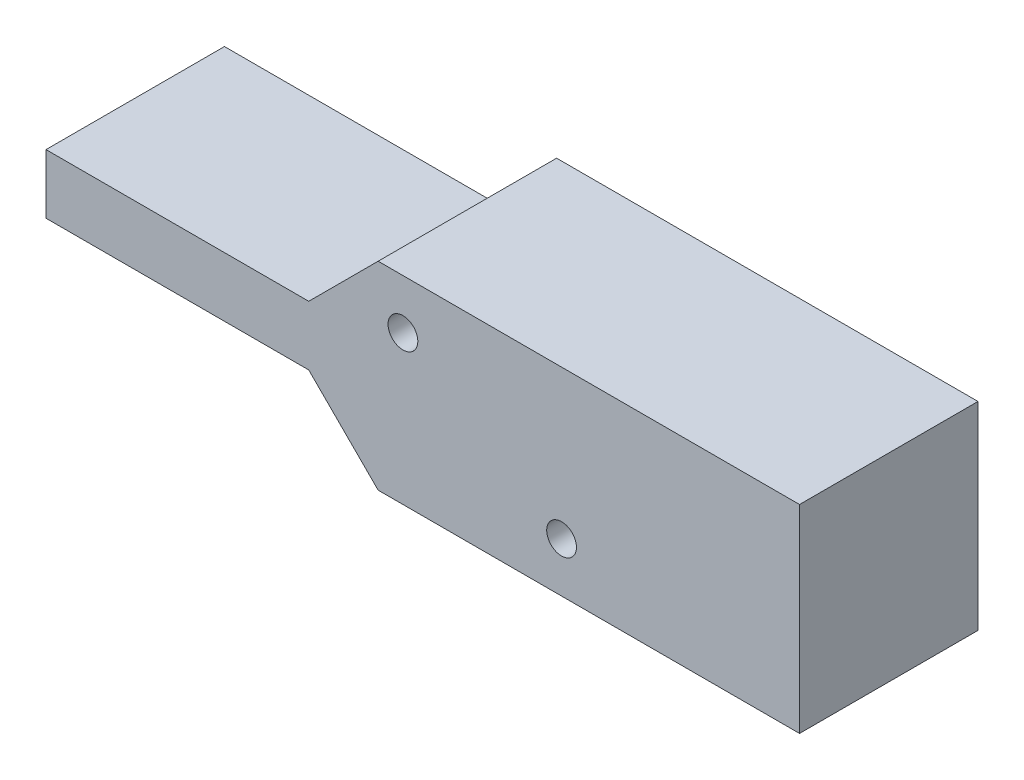
ISO-10303-21;
HEADER;
FILE_DESCRIPTION(('STEP AP214'),'2;1');
FILE_NAME('part.step','',(''),(''),'','','');
FILE_SCHEMA(('AUTOMOTIVE_DESIGN { 1 0 10303 214 1 1 1 1 }'));
ENDSEC;
DATA;
#1=APPLICATION_CONTEXT('core data for automotive mechanical design processes');
#2=APPLICATION_PROTOCOL_DEFINITION('international standard','automotive_design',2000,#1);
#3=PRODUCT_CONTEXT('',#1,'mechanical');
#4=PRODUCT('Part','Part','',(#3));
#5=PRODUCT_RELATED_PRODUCT_CATEGORY('part','',(#4));
#6=PRODUCT_DEFINITION_FORMATION('','',#4);
#7=PRODUCT_DEFINITION_CONTEXT('part definition',#1,'design');
#8=PRODUCT_DEFINITION('design','',#6,#7);
#9=PRODUCT_DEFINITION_SHAPE('','',#8);
#10=(LENGTH_UNIT() NAMED_UNIT(*) SI_UNIT(.MILLI.,.METRE.));
#11=(NAMED_UNIT(*) PLANE_ANGLE_UNIT() SI_UNIT($,.RADIAN.));
#12=(NAMED_UNIT(*) SI_UNIT($,.STERADIAN.) SOLID_ANGLE_UNIT());
#13=UNCERTAINTY_MEASURE_WITH_UNIT(LENGTH_MEASURE(1.E-05),#10,'distance_accuracy_value','');
#14=(GEOMETRIC_REPRESENTATION_CONTEXT(3) GLOBAL_UNCERTAINTY_ASSIGNED_CONTEXT((#13)) GLOBAL_UNIT_ASSIGNED_CONTEXT((#10,
#11,#12)) REPRESENTATION_CONTEXT('',''));
#15=CARTESIAN_POINT('',(0.,0.,0.));
#16=DIRECTION('',(0.,0.,1.));
#17=DIRECTION('',(1.,0.,0.));
#18=AXIS2_PLACEMENT_3D('',#15,#16,#17);
#19=CARTESIAN_POINT('',(0.,0.,18.));
#20=DIRECTION('',(0.,0.,1.));
#21=DIRECTION('',(1.,0.,0.));
#22=AXIS2_PLACEMENT_3D('',#19,#20,#21);
#23=PLANE('',#22);
#24=CARTESIAN_POINT('',(-40.,-5.,18.));
#25=DIRECTION('',(0.,0.,1.));
#26=DIRECTION('',(1.,0.,0.));
#27=AXIS2_PLACEMENT_3D('',#24,#25,#26);
#28=CIRCLE('',#27,1.5);
#29=CARTESIAN_POINT('',(-38.5,-5.,18.));
#30=VERTEX_POINT('',#29);
#31=EDGE_CURVE('E134',#30,#30,#28,.T.);
#32=ORIENTED_EDGE('',*,*,#31,.F.);
#33=EDGE_LOOP('',(#32));
#34=FACE_BOUND('',#33,.T.);
#35=DIRECTION('',(-1.,0.,0.));
#36=VECTOR('',#35,1.);
#37=CARTESIAN_POINT('',(-49.5,-7.,18.));
#38=LINE('',#37,#36);
#39=CARTESIAN_POINT('',(-49.5,-7.,18.));
#40=VERTEX_POINT('',#39);
#41=CARTESIAN_POINT('',(-76.,-7.,18.));
#42=VERTEX_POINT('',#41);
#43=EDGE_CURVE('E145',#40,#42,#38,.T.);
#44=ORIENTED_EDGE('',*,*,#43,.T.);
#45=DIRECTION('',(0.,-1.,0.));
#46=VECTOR('',#45,1.);
#47=CARTESIAN_POINT('',(-76.,-7.,18.));
#48=LINE('',#47,#46);
#49=CARTESIAN_POINT('',(-76.,-13.,18.));
#50=VERTEX_POINT('',#49);
#51=EDGE_CURVE('E93',#42,#50,#48,.T.);
#52=ORIENTED_EDGE('',*,*,#51,.T.);
#53=DIRECTION('',(1.,0.,0.));
#54=VECTOR('',#53,1.);
#55=CARTESIAN_POINT('',(-76.,-13.,18.));
#56=LINE('',#55,#54);
#57=CARTESIAN_POINT('',(-49.5,-13.,18.));
#58=VERTEX_POINT('',#57);
#59=EDGE_CURVE('E160',#50,#58,#56,.T.);
#60=ORIENTED_EDGE('',*,*,#59,.T.);
#61=DIRECTION('',(0.707106781186547,-0.707106781186547,0.));
#62=VECTOR('',#61,1.);
#63=CARTESIAN_POINT('',(-49.5,-13.,18.));
#64=LINE('',#63,#62);
#65=CARTESIAN_POINT('',(-42.5,-20.,18.));
#66=VERTEX_POINT('',#65);
#67=EDGE_CURVE('E173',#58,#66,#64,.T.);
#68=ORIENTED_EDGE('',*,*,#67,.T.);
#69=DIRECTION('',(1.,0.,0.));
#70=VECTOR('',#69,1.);
#71=CARTESIAN_POINT('',(-42.5,-20.,18.));
#72=LINE('',#71,#70);
#73=CARTESIAN_POINT('',(0.,-20.,18.));
#74=VERTEX_POINT('',#73);
#75=EDGE_CURVE('E112',#66,#74,#72,.T.);
#76=ORIENTED_EDGE('',*,*,#75,.T.);
#77=DIRECTION('',(0.,1.,0.));
#78=VECTOR('',#77,1.);
#79=CARTESIAN_POINT('',(0.,-20.,18.));
#80=LINE('',#79,#78);
#81=CARTESIAN_POINT('',(0.,0.,18.));
#82=VERTEX_POINT('',#81);
#83=EDGE_CURVE('E106',#74,#82,#80,.T.);
#84=ORIENTED_EDGE('',*,*,#83,.T.);
#85=DIRECTION('',(-1.,0.,0.));
#86=VECTOR('',#85,1.);
#87=CARTESIAN_POINT('',(0.,0.,18.));
#88=LINE('',#87,#86);
#89=CARTESIAN_POINT('',(-42.5,0.,18.));
#90=VERTEX_POINT('',#89);
#91=EDGE_CURVE('E110',#82,#90,#88,.T.);
#92=ORIENTED_EDGE('',*,*,#91,.T.);
#93=DIRECTION('',(-0.707106781186548,-0.707106781186547,0.));
#94=VECTOR('',#93,1.);
#95=CARTESIAN_POINT('',(-42.5,0.,18.));
#96=LINE('',#95,#94);
#97=EDGE_CURVE('E50',#90,#40,#96,.T.);
#98=ORIENTED_EDGE('',*,*,#97,.T.);
#99=EDGE_LOOP('',(#44,#52,#60,#68,#76,#84,#92,#98));
#100=FACE_BOUND('',#99,.T.);
#101=CARTESIAN_POINT('',(-24.,-15.,18.));
#102=DIRECTION('',(0.,0.,1.));
#103=DIRECTION('',(1.,0.,0.));
#104=AXIS2_PLACEMENT_3D('',#101,#102,#103);
#105=CIRCLE('',#104,1.5);
#106=CARTESIAN_POINT('',(-22.5,-15.,18.));
#107=VERTEX_POINT('',#106);
#108=EDGE_CURVE('E182',#107,#107,#105,.T.);
#109=ORIENTED_EDGE('',*,*,#108,.F.);
#110=EDGE_LOOP('',(#109));
#111=FACE_BOUND('',#110,.T.);
#112=ADVANCED_FACE('F33',(#34,#100,#111),#23,.T.);
#113=CARTESIAN_POINT('',(0.,0.,0.));
#114=DIRECTION('',(0.,0.,1.));
#115=DIRECTION('',(1.,0.,0.));
#116=AXIS2_PLACEMENT_3D('',#113,#114,#115);
#117=PLANE('',#116);
#118=CARTESIAN_POINT('',(-40.,-5.,0.));
#119=DIRECTION('',(0.,0.,1.));
#120=DIRECTION('',(1.,0.,0.));
#121=AXIS2_PLACEMENT_3D('',#118,#119,#120);
#122=CIRCLE('',#121,1.5);
#123=CARTESIAN_POINT('',(-38.5,-5.,0.));
#124=VERTEX_POINT('',#123);
#125=EDGE_CURVE('E179',#124,#124,#122,.T.);
#126=ORIENTED_EDGE('',*,*,#125,.T.);
#127=EDGE_LOOP('',(#126));
#128=FACE_BOUND('',#127,.T.);
#129=DIRECTION('',(-1.,0.,0.));
#130=VECTOR('',#129,1.);
#131=CARTESIAN_POINT('',(-49.5,-7.,0.));
#132=LINE('',#131,#130);
#133=CARTESIAN_POINT('',(-49.5,-7.,0.));
#134=VERTEX_POINT('',#133);
#135=CARTESIAN_POINT('',(-76.,-7.,0.));
#136=VERTEX_POINT('',#135);
#137=EDGE_CURVE('E130',#134,#136,#132,.T.);
#138=ORIENTED_EDGE('',*,*,#137,.F.);
#139=DIRECTION('',(-0.707106781186548,-0.707106781186547,0.));
#140=VECTOR('',#139,1.);
#141=CARTESIAN_POINT('',(-42.5,0.,0.));
#142=LINE('',#141,#140);
#143=CARTESIAN_POINT('',(-42.5,0.,0.));
#144=VERTEX_POINT('',#143);
#145=EDGE_CURVE('E85',#144,#134,#142,.T.);
#146=ORIENTED_EDGE('',*,*,#145,.F.);
#147=DIRECTION('',(-1.,0.,0.));
#148=VECTOR('',#147,1.);
#149=CARTESIAN_POINT('',(0.,0.,0.));
#150=LINE('',#149,#148);
#151=CARTESIAN_POINT('',(0.,0.,0.));
#152=VERTEX_POINT('',#151);
#153=EDGE_CURVE('E79',#152,#144,#150,.T.);
#154=ORIENTED_EDGE('',*,*,#153,.F.);
#155=DIRECTION('',(0.,1.,0.));
#156=VECTOR('',#155,1.);
#157=CARTESIAN_POINT('',(0.,-20.,0.));
#158=LINE('',#157,#156);
#159=CARTESIAN_POINT('',(0.,-20.,0.));
#160=VERTEX_POINT('',#159);
#161=EDGE_CURVE('E120',#160,#152,#158,.T.);
#162=ORIENTED_EDGE('',*,*,#161,.F.);
#163=DIRECTION('',(1.,0.,0.));
#164=VECTOR('',#163,1.);
#165=CARTESIAN_POINT('',(-42.5,-20.,0.));
#166=LINE('',#165,#164);
#167=CARTESIAN_POINT('',(-42.5,-20.,0.));
#168=VERTEX_POINT('',#167);
#169=EDGE_CURVE('E140',#168,#160,#166,.T.);
#170=ORIENTED_EDGE('',*,*,#169,.F.);
#171=DIRECTION('',(0.707106781186547,-0.707106781186547,0.));
#172=VECTOR('',#171,1.);
#173=CARTESIAN_POINT('',(-49.5,-13.,0.));
#174=LINE('',#173,#172);
#175=CARTESIAN_POINT('',(-49.5,-13.,0.));
#176=VERTEX_POINT('',#175);
#177=EDGE_CURVE('E138',#176,#168,#174,.T.);
#178=ORIENTED_EDGE('',*,*,#177,.F.);
#179=DIRECTION('',(1.,0.,0.));
#180=VECTOR('',#179,1.);
#181=CARTESIAN_POINT('',(-76.,-13.,0.));
#182=LINE('',#181,#180);
#183=CARTESIAN_POINT('',(-76.,-13.,0.));
#184=VERTEX_POINT('',#183);
#185=EDGE_CURVE('E136',#184,#176,#182,.T.);
#186=ORIENTED_EDGE('',*,*,#185,.F.);
#187=DIRECTION('',(0.,-1.,0.));
#188=VECTOR('',#187,1.);
#189=CARTESIAN_POINT('',(-76.,-7.,0.));
#190=LINE('',#189,#188);
#191=EDGE_CURVE('E133',#136,#184,#190,.T.);
#192=ORIENTED_EDGE('',*,*,#191,.F.);
#193=EDGE_LOOP('',(#138,#146,#154,#162,#170,#178,#186,#192));
#194=FACE_BOUND('',#193,.T.);
#195=CARTESIAN_POINT('',(-24.,-15.,0.));
#196=DIRECTION('',(0.,0.,1.));
#197=DIRECTION('',(1.,0.,0.));
#198=AXIS2_PLACEMENT_3D('',#195,#196,#197);
#199=CIRCLE('',#198,1.5);
#200=CARTESIAN_POINT('',(-22.5,-15.,0.));
#201=VERTEX_POINT('',#200);
#202=EDGE_CURVE('E185',#201,#201,#199,.T.);
#203=ORIENTED_EDGE('',*,*,#202,.T.);
#204=EDGE_LOOP('',(#203));
#205=FACE_BOUND('',#204,.T.);
#206=ADVANCED_FACE('F164',(#128,#194,#205),#117,.F.);
#207=CARTESIAN_POINT('',(-49.5,-7.,18.));
#208=DIRECTION('',(0.,-1.,0.));
#209=DIRECTION('',(1.,0.,0.));
#210=AXIS2_PLACEMENT_3D('',#207,#208,#209);
#211=PLANE('',#210);
#212=ORIENTED_EDGE('',*,*,#137,.T.);
#213=DIRECTION('',(0.,0.,-1.));
#214=VECTOR('',#213,1.);
#215=CARTESIAN_POINT('',(-76.,-7.,18.));
#216=LINE('',#215,#214);
#217=EDGE_CURVE('E11',#42,#136,#216,.T.);
#218=ORIENTED_EDGE('',*,*,#217,.F.);
#219=ORIENTED_EDGE('',*,*,#43,.F.);
#220=DIRECTION('',(0.,0.,-1.));
#221=VECTOR('',#220,1.);
#222=CARTESIAN_POINT('',(-49.5,-7.,18.));
#223=LINE('',#222,#221);
#224=EDGE_CURVE('E126',#40,#134,#223,.T.);
#225=ORIENTED_EDGE('',*,*,#224,.T.);
#226=EDGE_LOOP('',(#212,#218,#219,#225));
#227=FACE_BOUND('',#226,.T.);
#228=ADVANCED_FACE('F35',(#227),#211,.F.);
#229=CARTESIAN_POINT('',(-76.,-7.,18.));
#230=DIRECTION('',(1.,0.,0.));
#231=DIRECTION('',(0.,0.,-1.));
#232=AXIS2_PLACEMENT_3D('',#229,#230,#231);
#233=PLANE('',#232);
#234=ORIENTED_EDGE('',*,*,#191,.T.);
#235=DIRECTION('',(0.,0.,-1.));
#236=VECTOR('',#235,1.);
#237=CARTESIAN_POINT('',(-76.,-13.,18.));
#238=LINE('',#237,#236);
#239=EDGE_CURVE('E42',#50,#184,#238,.T.);
#240=ORIENTED_EDGE('',*,*,#239,.F.);
#241=ORIENTED_EDGE('',*,*,#51,.F.);
#242=ORIENTED_EDGE('',*,*,#217,.T.);
#243=EDGE_LOOP('',(#234,#240,#241,#242));
#244=FACE_BOUND('',#243,.T.);
#245=ADVANCED_FACE('F218',(#244),#233,.F.);
#246=CARTESIAN_POINT('',(-76.,-13.,18.));
#247=DIRECTION('',(0.,1.,0.));
#248=DIRECTION('',(-1.,0.,0.));
#249=AXIS2_PLACEMENT_3D('',#246,#247,#248);
#250=PLANE('',#249);
#251=ORIENTED_EDGE('',*,*,#185,.T.);
#252=DIRECTION('',(0.,0.,-1.));
#253=VECTOR('',#252,1.);
#254=CARTESIAN_POINT('',(-49.5,-13.,18.));
#255=LINE('',#254,#253);
#256=EDGE_CURVE('E152',#58,#176,#255,.T.);
#257=ORIENTED_EDGE('',*,*,#256,.F.);
#258=ORIENTED_EDGE('',*,*,#59,.F.);
#259=ORIENTED_EDGE('',*,*,#239,.T.);
#260=EDGE_LOOP('',(#251,#257,#258,#259));
#261=FACE_BOUND('',#260,.T.);
#262=ADVANCED_FACE('F158',(#261),#250,.F.);
#263=CARTESIAN_POINT('',(-49.5,-13.,18.));
#264=DIRECTION('',(0.707106781186547,0.707106781186547,0.));
#265=DIRECTION('',(-0.707106781186548,0.707106781186548,0.));
#266=AXIS2_PLACEMENT_3D('',#263,#264,#265);
#267=PLANE('',#266);
#268=ORIENTED_EDGE('',*,*,#177,.T.);
#269=DIRECTION('',(0.,0.,-1.));
#270=VECTOR('',#269,1.);
#271=CARTESIAN_POINT('',(-42.5,-20.,18.));
#272=LINE('',#271,#270);
#273=EDGE_CURVE('E149',#66,#168,#272,.T.);
#274=ORIENTED_EDGE('',*,*,#273,.F.);
#275=ORIENTED_EDGE('',*,*,#67,.F.);
#276=ORIENTED_EDGE('',*,*,#256,.T.);
#277=EDGE_LOOP('',(#268,#274,#275,#276));
#278=FACE_BOUND('',#277,.T.);
#279=ADVANCED_FACE('F169',(#278),#267,.F.);
#280=CARTESIAN_POINT('',(-42.5,-20.,18.));
#281=DIRECTION('',(0.,1.,0.));
#282=DIRECTION('',(-1.,0.,0.));
#283=AXIS2_PLACEMENT_3D('',#280,#281,#282);
#284=PLANE('',#283);
#285=ORIENTED_EDGE('',*,*,#169,.T.);
#286=DIRECTION('',(0.,0.,-1.));
#287=VECTOR('',#286,1.);
#288=CARTESIAN_POINT('',(0.,-20.,18.));
#289=LINE('',#288,#287);
#290=EDGE_CURVE('E121',#74,#160,#289,.T.);
#291=ORIENTED_EDGE('',*,*,#290,.F.);
#292=ORIENTED_EDGE('',*,*,#75,.F.);
#293=ORIENTED_EDGE('',*,*,#273,.T.);
#294=EDGE_LOOP('',(#285,#291,#292,#293));
#295=FACE_BOUND('',#294,.T.);
#296=ADVANCED_FACE('F172',(#295),#284,.F.);
#297=CARTESIAN_POINT('',(0.,-20.,18.));
#298=DIRECTION('',(-1.,0.,0.));
#299=DIRECTION('',(0.,0.,1.));
#300=AXIS2_PLACEMENT_3D('',#297,#298,#299);
#301=PLANE('',#300);
#302=ORIENTED_EDGE('',*,*,#161,.T.);
#303=DIRECTION('',(0.,0.,-1.));
#304=VECTOR('',#303,1.);
#305=CARTESIAN_POINT('',(0.,0.,18.));
#306=LINE('',#305,#304);
#307=EDGE_CURVE('E117',#82,#152,#306,.T.);
#308=ORIENTED_EDGE('',*,*,#307,.F.);
#309=ORIENTED_EDGE('',*,*,#83,.F.);
#310=ORIENTED_EDGE('',*,*,#290,.T.);
#311=EDGE_LOOP('',(#302,#308,#309,#310));
#312=FACE_BOUND('',#311,.T.);
#313=ADVANCED_FACE('F118',(#312),#301,.F.);
#314=CARTESIAN_POINT('',(0.,0.,18.));
#315=DIRECTION('',(0.,-1.,0.));
#316=DIRECTION('',(1.,0.,0.));
#317=AXIS2_PLACEMENT_3D('',#314,#315,#316);
#318=PLANE('',#317);
#319=ORIENTED_EDGE('',*,*,#153,.T.);
#320=DIRECTION('',(0.,0.,-1.));
#321=VECTOR('',#320,1.);
#322=CARTESIAN_POINT('',(-42.5,0.,18.));
#323=LINE('',#322,#321);
#324=EDGE_CURVE('E122',#90,#144,#323,.T.);
#325=ORIENTED_EDGE('',*,*,#324,.F.);
#326=ORIENTED_EDGE('',*,*,#91,.F.);
#327=ORIENTED_EDGE('',*,*,#307,.T.);
#328=EDGE_LOOP('',(#319,#325,#326,#327));
#329=FACE_BOUND('',#328,.T.);
#330=ADVANCED_FACE('F124',(#329),#318,.F.);
#331=CARTESIAN_POINT('',(-42.5,0.,18.));
#332=DIRECTION('',(0.707106781186547,-0.707106781186548,0.));
#333=DIRECTION('',(0.707106781186548,0.707106781186547,0.));
#334=AXIS2_PLACEMENT_3D('',#331,#332,#333);
#335=PLANE('',#334);
#336=ORIENTED_EDGE('',*,*,#145,.T.);
#337=ORIENTED_EDGE('',*,*,#224,.F.);
#338=ORIENTED_EDGE('',*,*,#97,.F.);
#339=ORIENTED_EDGE('',*,*,#324,.T.);
#340=EDGE_LOOP('',(#336,#337,#338,#339));
#341=FACE_BOUND('',#340,.T.);
#342=ADVANCED_FACE('F206',(#341),#335,.F.);
#343=CARTESIAN_POINT('',(-40.,-5.,18.));
#344=DIRECTION('',(0.,0.,-1.));
#345=DIRECTION('',(-1.,0.,0.));
#346=AXIS2_PLACEMENT_3D('',#343,#344,#345);
#347=CYLINDRICAL_SURFACE('',#346,1.5);
#348=ORIENTED_EDGE('',*,*,#31,.T.);
#349=EDGE_LOOP('',(#348));
#350=FACE_BOUND('',#349,.T.);
#351=ORIENTED_EDGE('',*,*,#125,.F.);
#352=EDGE_LOOP('',(#351));
#353=FACE_BOUND('',#352,.T.);
#354=ADVANCED_FACE('F203',(#350,#353),#347,.F.);
#355=CARTESIAN_POINT('',(-24.,-15.,18.));
#356=DIRECTION('',(0.,0.,-1.));
#357=DIRECTION('',(-1.,0.,0.));
#358=AXIS2_PLACEMENT_3D('',#355,#356,#357);
#359=CYLINDRICAL_SURFACE('',#358,1.5);
#360=ORIENTED_EDGE('',*,*,#108,.T.);
#361=EDGE_LOOP('',(#360));
#362=FACE_BOUND('',#361,.T.);
#363=ORIENTED_EDGE('',*,*,#202,.F.);
#364=EDGE_LOOP('',(#363));
#365=FACE_BOUND('',#364,.T.);
#366=ADVANCED_FACE('F191',(#362,#365),#359,.F.);
#367=CLOSED_SHELL('',(#112,#206,#228,#245,#262,#279,#296,#313,#330,#342,#354,#366));
#368=MANIFOLD_SOLID_BREP('B2',#367);
#369=ADVANCED_BREP_SHAPE_REPRESENTATION('',(#18,#368),#14);
#370=SHAPE_DEFINITION_REPRESENTATION(#9,#369);
ENDSEC;
END-ISO-10303-21;
